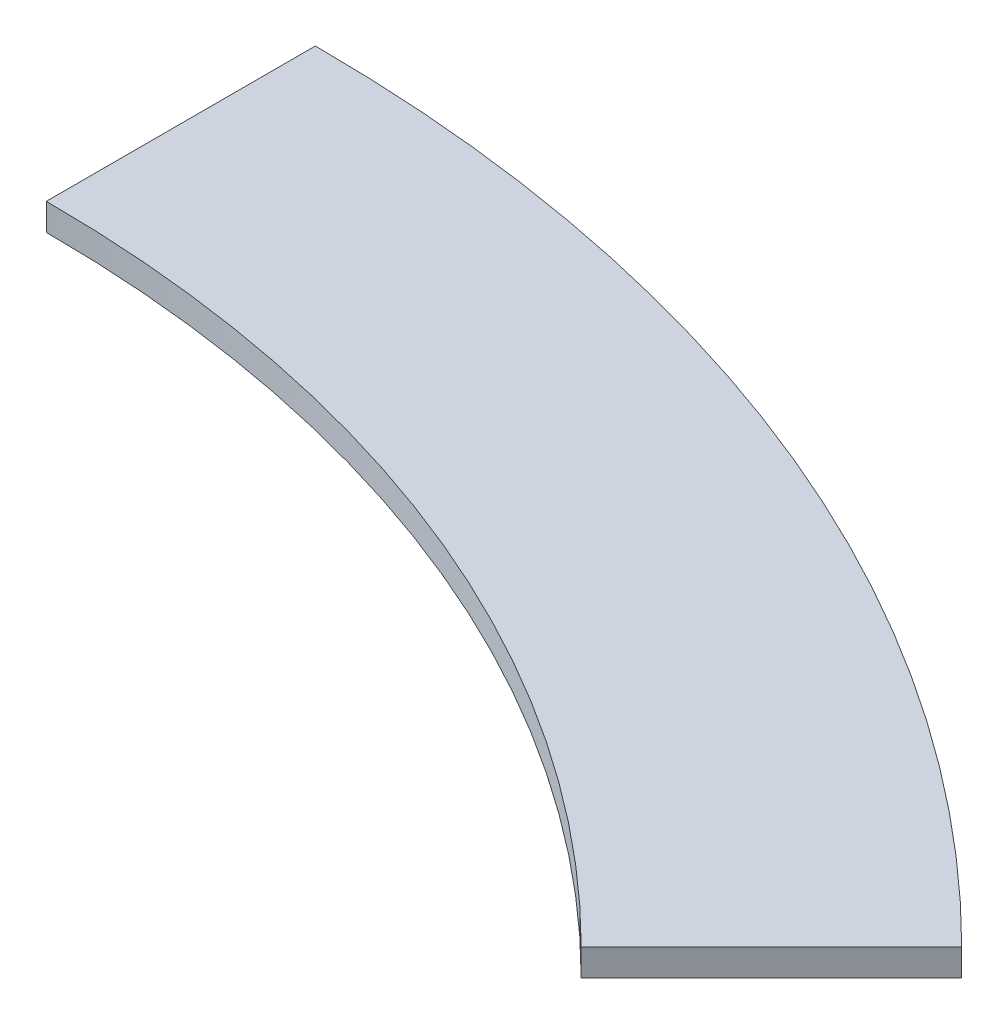
ISO-10303-21;
HEADER;
FILE_DESCRIPTION(('STEP AP214'),'2;1');
FILE_NAME('part.step','',(''),(''),'','','');
FILE_SCHEMA(('AUTOMOTIVE_DESIGN { 1 0 10303 214 1 1 1 1 }'));
ENDSEC;
DATA;
#1=APPLICATION_CONTEXT('core data for automotive mechanical design processes');
#2=APPLICATION_PROTOCOL_DEFINITION('international standard','automotive_design',2000,#1);
#3=PRODUCT_CONTEXT('',#1,'mechanical');
#4=PRODUCT('Part','Part','',(#3));
#5=PRODUCT_RELATED_PRODUCT_CATEGORY('part','',(#4));
#6=PRODUCT_DEFINITION_FORMATION('','',#4);
#7=PRODUCT_DEFINITION_CONTEXT('part definition',#1,'design');
#8=PRODUCT_DEFINITION('design','',#6,#7);
#9=PRODUCT_DEFINITION_SHAPE('','',#8);
#10=(LENGTH_UNIT() NAMED_UNIT(*) SI_UNIT(.MILLI.,.METRE.));
#11=(NAMED_UNIT(*) PLANE_ANGLE_UNIT() SI_UNIT($,.RADIAN.));
#12=(NAMED_UNIT(*) SI_UNIT($,.STERADIAN.) SOLID_ANGLE_UNIT());
#13=UNCERTAINTY_MEASURE_WITH_UNIT(LENGTH_MEASURE(1.E-05),#10,'distance_accuracy_value','');
#14=(GEOMETRIC_REPRESENTATION_CONTEXT(3) GLOBAL_UNCERTAINTY_ASSIGNED_CONTEXT((#13)) GLOBAL_UNIT_ASSIGNED_CONTEXT((#10,
#11,#12)) REPRESENTATION_CONTEXT('',''));
#15=CARTESIAN_POINT('',(0.,0.,0.));
#16=DIRECTION('',(0.,0.,1.));
#17=DIRECTION('',(1.,0.,0.));
#18=AXIS2_PLACEMENT_3D('',#15,#16,#17);
#19=CARTESIAN_POINT('',(0.,10.,0.));
#20=DIRECTION('',(0.,-1.,0.));
#21=DIRECTION('',(0.,0.,-1.));
#22=AXIS2_PLACEMENT_3D('',#19,#20,#21);
#23=CYLINDRICAL_SURFACE('',#22,580.);
#24=CARTESIAN_POINT('',(0.,0.,0.));
#25=DIRECTION('',(0.,1.,0.));
#26=DIRECTION('',(0.,0.,1.));
#27=AXIS2_PLACEMENT_3D('',#24,#25,#26);
#28=CIRCLE('',#27,580.);
#29=CARTESIAN_POINT('',(0.,0.,-580.));
#30=VERTEX_POINT('',#29);
#31=CARTESIAN_POINT('',(410.121933088198,0.,-410.121933088197));
#32=VERTEX_POINT('',#31);
#33=EDGE_CURVE('E97',#30,#32,#28,.F.);
#34=ORIENTED_EDGE('',*,*,#33,.F.);
#35=DIRECTION('',(0.,-1.,0.));
#36=VECTOR('',#35,1.);
#37=CARTESIAN_POINT('',(0.,10.,-580.));
#38=LINE('',#37,#36);
#39=CARTESIAN_POINT('',(0.,10.,-580.));
#40=VERTEX_POINT('',#39);
#41=EDGE_CURVE('E11',#40,#30,#38,.T.);
#42=ORIENTED_EDGE('',*,*,#41,.F.);
#43=CARTESIAN_POINT('',(0.,10.,0.));
#44=DIRECTION('',(0.,1.,0.));
#45=DIRECTION('',(0.,0.,1.));
#46=AXIS2_PLACEMENT_3D('',#43,#44,#45);
#47=CIRCLE('',#46,580.);
#48=CARTESIAN_POINT('',(410.121933088198,10.,-410.121933088197));
#49=VERTEX_POINT('',#48);
#50=EDGE_CURVE('E91',#40,#49,#47,.F.);
#51=ORIENTED_EDGE('',*,*,#50,.T.);
#52=DIRECTION('',(0.,-1.,0.));
#53=VECTOR('',#52,1.);
#54=CARTESIAN_POINT('',(410.121933088198,10.,-410.121933088197));
#55=LINE('',#54,#53);
#56=EDGE_CURVE('E72',#49,#32,#55,.T.);
#57=ORIENTED_EDGE('',*,*,#56,.T.);
#58=EDGE_LOOP('',(#34,#42,#51,#57));
#59=FACE_BOUND('',#58,.T.);
#60=ADVANCED_FACE('F34',(#59),#23,.T.);
#61=CARTESIAN_POINT('',(0.,10.,0.));
#62=DIRECTION('',(-1.,0.,0.));
#63=DIRECTION('',(0.,0.,1.));
#64=AXIS2_PLACEMENT_3D('',#61,#62,#63);
#65=PLANE('',#64);
#66=DIRECTION('',(0.,0.,-1.));
#67=VECTOR('',#66,1.);
#68=CARTESIAN_POINT('',(0.,0.,0.));
#69=LINE('',#68,#67);
#70=CARTESIAN_POINT('',(0.,0.,-480.));
#71=VERTEX_POINT('',#70);
#72=EDGE_CURVE('E85',#71,#30,#69,.T.);
#73=ORIENTED_EDGE('',*,*,#72,.F.);
#74=DIRECTION('',(0.,-1.,0.));
#75=VECTOR('',#74,1.);
#76=CARTESIAN_POINT('',(0.,10.,-480.));
#77=LINE('',#76,#75);
#78=CARTESIAN_POINT('',(0.,10.,-480.));
#79=VERTEX_POINT('',#78);
#80=EDGE_CURVE('E42',#79,#71,#77,.T.);
#81=ORIENTED_EDGE('',*,*,#80,.F.);
#82=DIRECTION('',(0.,0.,-1.));
#83=VECTOR('',#82,1.);
#84=CARTESIAN_POINT('',(0.,10.,0.));
#85=LINE('',#84,#83);
#86=EDGE_CURVE('E83',#79,#40,#85,.T.);
#87=ORIENTED_EDGE('',*,*,#86,.T.);
#88=ORIENTED_EDGE('',*,*,#41,.T.);
#89=EDGE_LOOP('',(#73,#81,#87,#88));
#90=FACE_BOUND('',#89,.T.);
#91=ADVANCED_FACE('F81',(#90),#65,.T.);
#92=CARTESIAN_POINT('',(0.,10.,0.));
#93=DIRECTION('',(0.,-1.,0.));
#94=DIRECTION('',(0.,0.,-1.));
#95=AXIS2_PLACEMENT_3D('',#92,#93,#94);
#96=CYLINDRICAL_SURFACE('',#95,480.);
#97=CARTESIAN_POINT('',(0.,0.,0.));
#98=DIRECTION('',(0.,1.,0.));
#99=DIRECTION('',(0.,0.,1.));
#100=AXIS2_PLACEMENT_3D('',#97,#98,#99);
#101=CIRCLE('',#100,480.);
#102=CARTESIAN_POINT('',(339.411254969543,0.,-339.411254969542));
#103=VERTEX_POINT('',#102);
#104=EDGE_CURVE('E65',#71,#103,#101,.F.);
#105=ORIENTED_EDGE('',*,*,#104,.T.);
#106=DIRECTION('',(0.,-1.,0.));
#107=VECTOR('',#106,1.);
#108=CARTESIAN_POINT('',(339.411254969543,10.,-339.411254969542));
#109=LINE('',#108,#107);
#110=CARTESIAN_POINT('',(339.411254969543,10.,-339.411254969542));
#111=VERTEX_POINT('',#110);
#112=EDGE_CURVE('E86',#111,#103,#109,.T.);
#113=ORIENTED_EDGE('',*,*,#112,.F.);
#114=CARTESIAN_POINT('',(0.,10.,0.));
#115=DIRECTION('',(0.,1.,0.));
#116=DIRECTION('',(0.,0.,1.));
#117=AXIS2_PLACEMENT_3D('',#114,#115,#116);
#118=CIRCLE('',#117,480.);
#119=EDGE_CURVE('E87',#79,#111,#118,.F.);
#120=ORIENTED_EDGE('',*,*,#119,.F.);
#121=ORIENTED_EDGE('',*,*,#80,.T.);
#122=EDGE_LOOP('',(#105,#113,#120,#121));
#123=FACE_BOUND('',#122,.T.);
#124=ADVANCED_FACE('F88',(#123),#96,.F.);
#125=CARTESIAN_POINT('',(-1.3738309013483E-13,10.,-1.37383090134831E-13));
#126=DIRECTION('',(-0.707106781186546,0.,-0.707106781186549));
#127=DIRECTION('',(-0.707106781186549,0.,0.707106781186546));
#128=AXIS2_PLACEMENT_3D('',#125,#126,#127);
#129=PLANE('',#128);
#130=DIRECTION('',(0.707106781186549,0.,-0.707106781186546));
#131=VECTOR('',#130,1.);
#132=CARTESIAN_POINT('',(-1.3738309013483E-13,0.,-1.37383090134831E-13));
#133=LINE('',#132,#131);
#134=EDGE_CURVE('E93',#103,#32,#133,.T.);
#135=ORIENTED_EDGE('',*,*,#134,.T.);
#136=ORIENTED_EDGE('',*,*,#56,.F.);
#137=DIRECTION('',(0.707106781186549,0.,-0.707106781186546));
#138=VECTOR('',#137,1.);
#139=CARTESIAN_POINT('',(-1.3738309013483E-13,10.,-1.37383090134831E-13));
#140=LINE('',#139,#138);
#141=EDGE_CURVE('E50',#111,#49,#140,.T.);
#142=ORIENTED_EDGE('',*,*,#141,.F.);
#143=ORIENTED_EDGE('',*,*,#112,.T.);
#144=EDGE_LOOP('',(#135,#136,#142,#143));
#145=FACE_BOUND('',#144,.T.);
#146=ADVANCED_FACE('F106',(#145),#129,.F.);
#147=CARTESIAN_POINT('',(0.,10.,0.));
#148=DIRECTION('',(0.,1.,0.));
#149=DIRECTION('',(0.,0.,1.));
#150=AXIS2_PLACEMENT_3D('',#147,#148,#149);
#151=PLANE('',#150);
#152=ORIENTED_EDGE('',*,*,#50,.F.);
#153=ORIENTED_EDGE('',*,*,#86,.F.);
#154=ORIENTED_EDGE('',*,*,#119,.T.);
#155=ORIENTED_EDGE('',*,*,#141,.T.);
#156=EDGE_LOOP('',(#152,#153,#154,#155));
#157=FACE_BOUND('',#156,.T.);
#158=ADVANCED_FACE('F90',(#157),#151,.T.);
#159=CARTESIAN_POINT('',(0.,0.,0.));
#160=DIRECTION('',(0.,1.,0.));
#161=DIRECTION('',(0.,0.,1.));
#162=AXIS2_PLACEMENT_3D('',#159,#160,#161);
#163=PLANE('',#162);
#164=ORIENTED_EDGE('',*,*,#33,.T.);
#165=ORIENTED_EDGE('',*,*,#134,.F.);
#166=ORIENTED_EDGE('',*,*,#104,.F.);
#167=ORIENTED_EDGE('',*,*,#72,.T.);
#168=EDGE_LOOP('',(#164,#165,#166,#167));
#169=FACE_BOUND('',#168,.T.);
#170=ADVANCED_FACE('F108',(#169),#163,.F.);
#171=CLOSED_SHELL('',(#60,#91,#124,#146,#158,#170));
#172=MANIFOLD_SOLID_BREP('B2',#171);
#173=ADVANCED_BREP_SHAPE_REPRESENTATION('',(#18,#172),#14);
#174=SHAPE_DEFINITION_REPRESENTATION(#9,#173);
ENDSEC;
END-ISO-10303-21;
